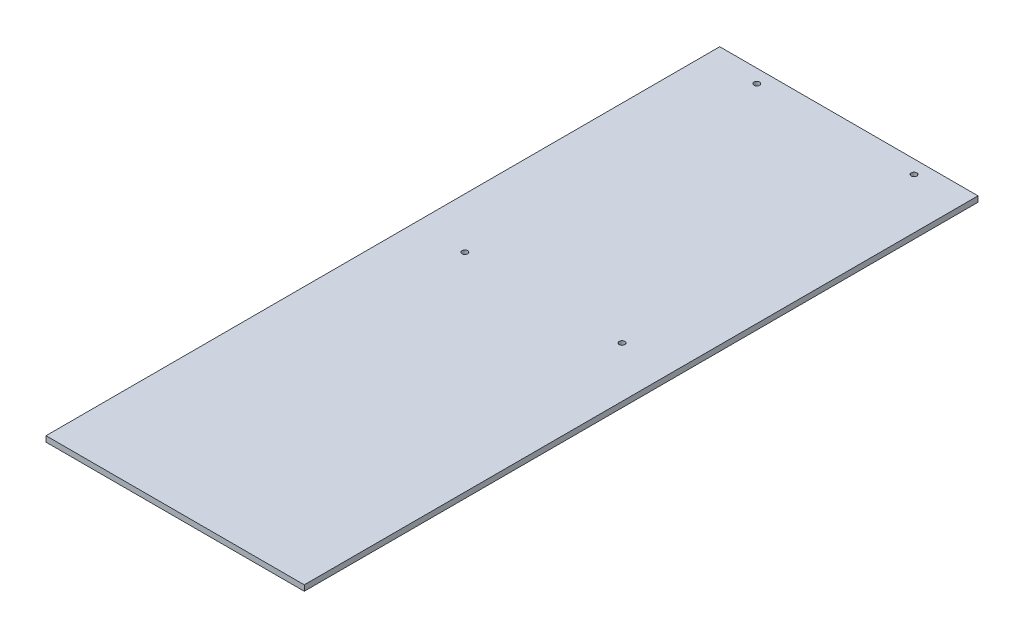
ISO-10303-21;
HEADER;
FILE_DESCRIPTION(('STEP AP214'),'2;1');
FILE_NAME('part.step','',(''),(''),'','','');
FILE_SCHEMA(('AUTOMOTIVE_DESIGN { 1 0 10303 214 1 1 1 1 }'));
ENDSEC;
DATA;
#1=APPLICATION_CONTEXT('core data for automotive mechanical design processes');
#2=APPLICATION_PROTOCOL_DEFINITION('international standard','automotive_design',2000,#1);
#3=PRODUCT_CONTEXT('',#1,'mechanical');
#4=PRODUCT('Part','Part','',(#3));
#5=PRODUCT_RELATED_PRODUCT_CATEGORY('part','',(#4));
#6=PRODUCT_DEFINITION_FORMATION('','',#4);
#7=PRODUCT_DEFINITION_CONTEXT('part definition',#1,'design');
#8=PRODUCT_DEFINITION('design','',#6,#7);
#9=PRODUCT_DEFINITION_SHAPE('','',#8);
#10=(LENGTH_UNIT() NAMED_UNIT(*) SI_UNIT(.MILLI.,.METRE.));
#11=(NAMED_UNIT(*) PLANE_ANGLE_UNIT() SI_UNIT($,.RADIAN.));
#12=(NAMED_UNIT(*) SI_UNIT($,.STERADIAN.) SOLID_ANGLE_UNIT());
#13=UNCERTAINTY_MEASURE_WITH_UNIT(LENGTH_MEASURE(1.E-05),#10,'distance_accuracy_value','');
#14=(GEOMETRIC_REPRESENTATION_CONTEXT(3) GLOBAL_UNCERTAINTY_ASSIGNED_CONTEXT((#13)) GLOBAL_UNIT_ASSIGNED_CONTEXT((#10,
#11,#12)) REPRESENTATION_CONTEXT('',''));
#15=CARTESIAN_POINT('',(0.,0.,0.));
#16=DIRECTION('',(0.,0.,1.));
#17=DIRECTION('',(1.,0.,0.));
#18=AXIS2_PLACEMENT_3D('',#15,#16,#17);
#19=CARTESIAN_POINT('',(0.,5.,0.));
#20=DIRECTION('',(1.,0.,0.));
#21=DIRECTION('',(0.,0.,-1.));
#22=AXIS2_PLACEMENT_3D('',#19,#20,#21);
#23=PLANE('',#22);
#24=DIRECTION('',(0.,0.,1.));
#25=VECTOR('',#24,1.);
#26=CARTESIAN_POINT('',(0.,0.,0.));
#27=LINE('',#26,#25);
#28=CARTESIAN_POINT('',(0.,0.,-600.));
#29=VERTEX_POINT('',#28);
#30=CARTESIAN_POINT('',(0.,0.,0.));
#31=VERTEX_POINT('',#30);
#32=EDGE_CURVE('E98',#29,#31,#27,.T.);
#33=ORIENTED_EDGE('',*,*,#32,.T.);
#34=DIRECTION('',(0.,-1.,0.));
#35=VECTOR('',#34,1.);
#36=CARTESIAN_POINT('',(0.,5.,0.));
#37=LINE('',#36,#35);
#38=CARTESIAN_POINT('',(0.,5.,0.));
#39=VERTEX_POINT('',#38);
#40=EDGE_CURVE('E11',#39,#31,#37,.T.);
#41=ORIENTED_EDGE('',*,*,#40,.F.);
#42=DIRECTION('',(0.,0.,1.));
#43=VECTOR('',#42,1.);
#44=CARTESIAN_POINT('',(0.,5.,0.));
#45=LINE('',#44,#43);
#46=CARTESIAN_POINT('',(0.,5.,-600.));
#47=VERTEX_POINT('',#46);
#48=EDGE_CURVE('E85',#47,#39,#45,.T.);
#49=ORIENTED_EDGE('',*,*,#48,.F.);
#50=DIRECTION('',(0.,-1.,0.));
#51=VECTOR('',#50,1.);
#52=CARTESIAN_POINT('',(0.,5.,-600.));
#53=LINE('',#52,#51);
#54=EDGE_CURVE('E94',#47,#29,#53,.T.);
#55=ORIENTED_EDGE('',*,*,#54,.T.);
#56=EDGE_LOOP('',(#33,#41,#49,#55));
#57=FACE_BOUND('',#56,.T.);
#58=ADVANCED_FACE('F32',(#57),#23,.F.);
#59=CARTESIAN_POINT('',(0.,5.,0.));
#60=DIRECTION('',(0.,0.,-1.));
#61=DIRECTION('',(-1.,0.,0.));
#62=AXIS2_PLACEMENT_3D('',#59,#60,#61);
#63=PLANE('',#62);
#64=DIRECTION('',(1.,0.,0.));
#65=VECTOR('',#64,1.);
#66=CARTESIAN_POINT('',(0.,0.,0.));
#67=LINE('',#66,#65);
#68=CARTESIAN_POINT('',(230.,0.,0.));
#69=VERTEX_POINT('',#68);
#70=EDGE_CURVE('E89',#31,#69,#67,.T.);
#71=ORIENTED_EDGE('',*,*,#70,.T.);
#72=DIRECTION('',(0.,-1.,0.));
#73=VECTOR('',#72,1.);
#74=CARTESIAN_POINT('',(230.,5.,0.));
#75=LINE('',#74,#73);
#76=CARTESIAN_POINT('',(230.,5.,0.));
#77=VERTEX_POINT('',#76);
#78=EDGE_CURVE('E41',#77,#69,#75,.T.);
#79=ORIENTED_EDGE('',*,*,#78,.F.);
#80=DIRECTION('',(1.,0.,0.));
#81=VECTOR('',#80,1.);
#82=CARTESIAN_POINT('',(0.,5.,0.));
#83=LINE('',#82,#81);
#84=EDGE_CURVE('E80',#39,#77,#83,.T.);
#85=ORIENTED_EDGE('',*,*,#84,.F.);
#86=ORIENTED_EDGE('',*,*,#40,.T.);
#87=EDGE_LOOP('',(#71,#79,#85,#86));
#88=FACE_BOUND('',#87,.T.);
#89=ADVANCED_FACE('F88',(#88),#63,.F.);
#90=CARTESIAN_POINT('',(230.,5.,0.));
#91=DIRECTION('',(-1.,0.,0.));
#92=DIRECTION('',(0.,0.,1.));
#93=AXIS2_PLACEMENT_3D('',#90,#91,#92);
#94=PLANE('',#93);
#95=DIRECTION('',(0.,0.,-1.));
#96=VECTOR('',#95,1.);
#97=CARTESIAN_POINT('',(230.,0.,0.));
#98=LINE('',#97,#96);
#99=CARTESIAN_POINT('',(230.,0.,-600.));
#100=VERTEX_POINT('',#99);
#101=EDGE_CURVE('E67',#69,#100,#98,.T.);
#102=ORIENTED_EDGE('',*,*,#101,.T.);
#103=DIRECTION('',(0.,-1.,0.));
#104=VECTOR('',#103,1.);
#105=CARTESIAN_POINT('',(230.,5.,-600.));
#106=LINE('',#105,#104);
#107=CARTESIAN_POINT('',(230.,5.,-600.));
#108=VERTEX_POINT('',#107);
#109=EDGE_CURVE('E90',#108,#100,#106,.T.);
#110=ORIENTED_EDGE('',*,*,#109,.F.);
#111=DIRECTION('',(0.,0.,-1.));
#112=VECTOR('',#111,1.);
#113=CARTESIAN_POINT('',(230.,5.,0.));
#114=LINE('',#113,#112);
#115=EDGE_CURVE('E83',#77,#108,#114,.T.);
#116=ORIENTED_EDGE('',*,*,#115,.F.);
#117=ORIENTED_EDGE('',*,*,#78,.T.);
#118=EDGE_LOOP('',(#102,#110,#116,#117));
#119=FACE_BOUND('',#118,.T.);
#120=ADVANCED_FACE('F92',(#119),#94,.F.);
#121=CARTESIAN_POINT('',(0.,5.,-600.));
#122=DIRECTION('',(0.,0.,1.));
#123=DIRECTION('',(1.,0.,0.));
#124=AXIS2_PLACEMENT_3D('',#121,#122,#123);
#125=PLANE('',#124);
#126=DIRECTION('',(-1.,0.,0.));
#127=VECTOR('',#126,1.);
#128=CARTESIAN_POINT('',(0.,0.,-600.));
#129=LINE('',#128,#127);
#130=EDGE_CURVE('E73',#100,#29,#129,.T.);
#131=ORIENTED_EDGE('',*,*,#130,.T.);
#132=ORIENTED_EDGE('',*,*,#54,.F.);
#133=DIRECTION('',(-1.,0.,0.));
#134=VECTOR('',#133,1.);
#135=CARTESIAN_POINT('',(0.,5.,-600.));
#136=LINE('',#135,#134);
#137=EDGE_CURVE('E50',#108,#47,#136,.T.);
#138=ORIENTED_EDGE('',*,*,#137,.F.);
#139=ORIENTED_EDGE('',*,*,#109,.T.);
#140=EDGE_LOOP('',(#131,#132,#138,#139));
#141=FACE_BOUND('',#140,.T.);
#142=ADVANCED_FACE('F134',(#141),#125,.F.);
#143=CARTESIAN_POINT('',(0.,5.,0.));
#144=DIRECTION('',(0.,-1.,0.));
#145=DIRECTION('',(0.,0.,-1.));
#146=AXIS2_PLACEMENT_3D('',#143,#144,#145);
#147=PLANE('',#146);
#148=CARTESIAN_POINT('',(44.99,5.,-588.));
#149=DIRECTION('',(0.,1.,0.));
#150=DIRECTION('',(0.,0.,1.));
#151=AXIS2_PLACEMENT_3D('',#148,#149,#150);
#152=CIRCLE('',#151,2.5);
#153=CARTESIAN_POINT('',(44.99,5.,-585.5));
#154=VERTEX_POINT('',#153);
#155=EDGE_CURVE('E215',#154,#154,#152,.T.);
#156=ORIENTED_EDGE('',*,*,#155,.F.);
#157=EDGE_LOOP('',(#156));
#158=FACE_BOUND('',#157,.T.);
#159=CARTESIAN_POINT('',(185.,5.,-328.000000192307));
#160=DIRECTION('',(0.,1.,0.));
#161=DIRECTION('',(0.,0.,1.));
#162=AXIS2_PLACEMENT_3D('',#159,#160,#161);
#163=CIRCLE('',#162,2.5);
#164=CARTESIAN_POINT('',(185.,5.,-325.500000192307));
#165=VERTEX_POINT('',#164);
#166=EDGE_CURVE('E213',#165,#165,#163,.T.);
#167=ORIENTED_EDGE('',*,*,#166,.F.);
#168=EDGE_LOOP('',(#167));
#169=FACE_BOUND('',#168,.T.);
#170=CARTESIAN_POINT('',(45.,5.,-328.000000192307));
#171=DIRECTION('',(0.,1.,0.));
#172=DIRECTION('',(0.,0.,1.));
#173=AXIS2_PLACEMENT_3D('',#170,#171,#172);
#174=CIRCLE('',#173,2.5);
#175=CARTESIAN_POINT('',(45.,5.,-325.500000192307));
#176=VERTEX_POINT('',#175);
#177=EDGE_CURVE('E216',#176,#176,#174,.T.);
#178=ORIENTED_EDGE('',*,*,#177,.F.);
#179=EDGE_LOOP('',(#178));
#180=FACE_BOUND('',#179,.T.);
#181=CARTESIAN_POINT('',(185.01,5.,-588.));
#182=DIRECTION('',(0.,1.,0.));
#183=DIRECTION('',(0.,0.,1.));
#184=AXIS2_PLACEMENT_3D('',#181,#182,#183);
#185=CIRCLE('',#184,2.5);
#186=CARTESIAN_POINT('',(185.01,5.,-585.5));
#187=VERTEX_POINT('',#186);
#188=EDGE_CURVE('E110',#187,#187,#185,.T.);
#189=ORIENTED_EDGE('',*,*,#188,.F.);
#190=EDGE_LOOP('',(#189));
#191=FACE_BOUND('',#190,.T.);
#192=ORIENTED_EDGE('',*,*,#48,.T.);
#193=ORIENTED_EDGE('',*,*,#84,.T.);
#194=ORIENTED_EDGE('',*,*,#115,.T.);
#195=ORIENTED_EDGE('',*,*,#137,.T.);
#196=EDGE_LOOP('',(#192,#193,#194,#195));
#197=FACE_BOUND('',#196,.T.);
#198=ADVANCED_FACE('F81',(#158,#169,#180,#191,#197),#147,.F.);
#199=CARTESIAN_POINT('',(0.,0.,0.));
#200=DIRECTION('',(0.,-1.,0.));
#201=DIRECTION('',(0.,0.,-1.));
#202=AXIS2_PLACEMENT_3D('',#199,#200,#201);
#203=PLANE('',#202);
#204=CARTESIAN_POINT('',(44.99,0.,-588.));
#205=DIRECTION('',(0.,-1.,0.));
#206=DIRECTION('',(0.,0.,-1.));
#207=AXIS2_PLACEMENT_3D('',#204,#205,#206);
#208=CIRCLE('',#207,2.5);
#209=CARTESIAN_POINT('',(44.99,0.,-590.5));
#210=VERTEX_POINT('',#209);
#211=EDGE_CURVE('E35',#210,#210,#208,.T.);
#212=ORIENTED_EDGE('',*,*,#211,.F.);
#213=EDGE_LOOP('',(#212));
#214=FACE_BOUND('',#213,.T.);
#215=CARTESIAN_POINT('',(185.,0.,-328.000000192307));
#216=DIRECTION('',(0.,-1.,0.));
#217=DIRECTION('',(0.,0.,-1.));
#218=AXIS2_PLACEMENT_3D('',#215,#216,#217);
#219=CIRCLE('',#218,2.5);
#220=CARTESIAN_POINT('',(185.,0.,-330.500000192307));
#221=VERTEX_POINT('',#220);
#222=EDGE_CURVE('E112',#221,#221,#219,.T.);
#223=ORIENTED_EDGE('',*,*,#222,.F.);
#224=EDGE_LOOP('',(#223));
#225=FACE_BOUND('',#224,.T.);
#226=CARTESIAN_POINT('',(45.,0.,-328.000000192307));
#227=DIRECTION('',(0.,-1.,0.));
#228=DIRECTION('',(0.,0.,-1.));
#229=AXIS2_PLACEMENT_3D('',#226,#227,#228);
#230=CIRCLE('',#229,2.5);
#231=CARTESIAN_POINT('',(45.,0.,-330.500000192307));
#232=VERTEX_POINT('',#231);
#233=EDGE_CURVE('E109',#232,#232,#230,.T.);
#234=ORIENTED_EDGE('',*,*,#233,.F.);
#235=EDGE_LOOP('',(#234));
#236=FACE_BOUND('',#235,.T.);
#237=CARTESIAN_POINT('',(185.01,0.,-588.));
#238=DIRECTION('',(0.,-1.,0.));
#239=DIRECTION('',(0.,0.,-1.));
#240=AXIS2_PLACEMENT_3D('',#237,#238,#239);
#241=CIRCLE('',#240,2.5);
#242=CARTESIAN_POINT('',(185.01,0.,-590.5));
#243=VERTEX_POINT('',#242);
#244=EDGE_CURVE('E106',#243,#243,#241,.T.);
#245=ORIENTED_EDGE('',*,*,#244,.F.);
#246=EDGE_LOOP('',(#245));
#247=FACE_BOUND('',#246,.T.);
#248=ORIENTED_EDGE('',*,*,#32,.F.);
#249=ORIENTED_EDGE('',*,*,#130,.F.);
#250=ORIENTED_EDGE('',*,*,#101,.F.);
#251=ORIENTED_EDGE('',*,*,#70,.F.);
#252=EDGE_LOOP('',(#248,#249,#250,#251));
#253=FACE_BOUND('',#252,.T.);
#254=ADVANCED_FACE('F122',(#214,#225,#236,#247,#253),#203,.T.);
#255=CARTESIAN_POINT('',(185.01,-5.,-588.));
#256=DIRECTION('',(0.,1.,0.));
#257=DIRECTION('',(0.,0.,1.));
#258=AXIS2_PLACEMENT_3D('',#255,#256,#257);
#259=CYLINDRICAL_SURFACE('',#258,2.5);
#260=ORIENTED_EDGE('',*,*,#244,.T.);
#261=EDGE_LOOP('',(#260));
#262=FACE_BOUND('',#261,.T.);
#263=ORIENTED_EDGE('',*,*,#188,.T.);
#264=EDGE_LOOP('',(#263));
#265=FACE_BOUND('',#264,.T.);
#266=ADVANCED_FACE('F125',(#262,#265),#259,.F.);
#267=CARTESIAN_POINT('',(45.,-5.,-328.000000192307));
#268=DIRECTION('',(0.,1.,0.));
#269=DIRECTION('',(0.,0.,1.));
#270=AXIS2_PLACEMENT_3D('',#267,#268,#269);
#271=CYLINDRICAL_SURFACE('',#270,2.5);
#272=ORIENTED_EDGE('',*,*,#233,.T.);
#273=EDGE_LOOP('',(#272));
#274=FACE_BOUND('',#273,.T.);
#275=ORIENTED_EDGE('',*,*,#177,.T.);
#276=EDGE_LOOP('',(#275));
#277=FACE_BOUND('',#276,.T.);
#278=ADVANCED_FACE('F179',(#274,#277),#271,.F.);
#279=CARTESIAN_POINT('',(185.,-5.,-328.000000192307));
#280=DIRECTION('',(0.,1.,0.));
#281=DIRECTION('',(0.,0.,1.));
#282=AXIS2_PLACEMENT_3D('',#279,#280,#281);
#283=CYLINDRICAL_SURFACE('',#282,2.5);
#284=ORIENTED_EDGE('',*,*,#222,.T.);
#285=EDGE_LOOP('',(#284));
#286=FACE_BOUND('',#285,.T.);
#287=ORIENTED_EDGE('',*,*,#166,.T.);
#288=EDGE_LOOP('',(#287));
#289=FACE_BOUND('',#288,.T.);
#290=ADVANCED_FACE('F189',(#286,#289),#283,.F.);
#291=CARTESIAN_POINT('',(44.99,-5.,-588.));
#292=DIRECTION('',(0.,1.,0.));
#293=DIRECTION('',(0.,0.,1.));
#294=AXIS2_PLACEMENT_3D('',#291,#292,#293);
#295=CYLINDRICAL_SURFACE('',#294,2.5);
#296=ORIENTED_EDGE('',*,*,#211,.T.);
#297=EDGE_LOOP('',(#296));
#298=FACE_BOUND('',#297,.T.);
#299=ORIENTED_EDGE('',*,*,#155,.T.);
#300=EDGE_LOOP('',(#299));
#301=FACE_BOUND('',#300,.T.);
#302=ADVANCED_FACE('F119',(#298,#301),#295,.F.);
#303=CLOSED_SHELL('',(#58,#89,#120,#142,#198,#254,#266,#278,#290,#302));
#304=MANIFOLD_SOLID_BREP('B2',#303);
#305=ADVANCED_BREP_SHAPE_REPRESENTATION('',(#18,#304),#14);
#306=SHAPE_DEFINITION_REPRESENTATION(#9,#305);
ENDSEC;
END-ISO-10303-21;
